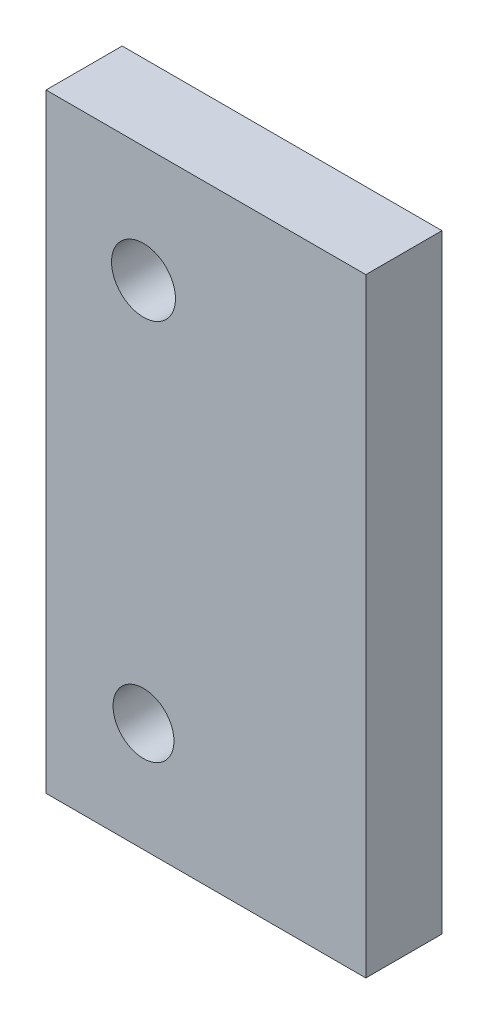
ISO-10303-21;
HEADER;
FILE_DESCRIPTION(('STEP AP214'),'2;1');
FILE_NAME('part.step','',(''),(''),'','','');
FILE_SCHEMA(('AUTOMOTIVE_DESIGN { 1 0 10303 214 1 1 1 1 }'));
ENDSEC;
DATA;
#1=APPLICATION_CONTEXT('core data for automotive mechanical design processes');
#2=APPLICATION_PROTOCOL_DEFINITION('international standard','automotive_design',2000,#1);
#3=PRODUCT_CONTEXT('',#1,'mechanical');
#4=PRODUCT('Part','Part','',(#3));
#5=PRODUCT_RELATED_PRODUCT_CATEGORY('part','',(#4));
#6=PRODUCT_DEFINITION_FORMATION('','',#4);
#7=PRODUCT_DEFINITION_CONTEXT('part definition',#1,'design');
#8=PRODUCT_DEFINITION('design','',#6,#7);
#9=PRODUCT_DEFINITION_SHAPE('','',#8);
#10=(LENGTH_UNIT() NAMED_UNIT(*) SI_UNIT(.MILLI.,.METRE.));
#11=(NAMED_UNIT(*) PLANE_ANGLE_UNIT() SI_UNIT($,.RADIAN.));
#12=(NAMED_UNIT(*) SI_UNIT($,.STERADIAN.) SOLID_ANGLE_UNIT());
#13=UNCERTAINTY_MEASURE_WITH_UNIT(LENGTH_MEASURE(1.E-05),#10,'distance_accuracy_value','');
#14=(GEOMETRIC_REPRESENTATION_CONTEXT(3) GLOBAL_UNCERTAINTY_ASSIGNED_CONTEXT((#13)) GLOBAL_UNIT_ASSIGNED_CONTEXT((#10,
#11,#12)) REPRESENTATION_CONTEXT('',''));
#15=CARTESIAN_POINT('',(0.,0.,0.));
#16=DIRECTION('',(0.,0.,1.));
#17=DIRECTION('',(1.,0.,0.));
#18=AXIS2_PLACEMENT_3D('',#15,#16,#17);
#19=CARTESIAN_POINT('',(10.5,0.,2.5));
#20=DIRECTION('',(0.,1.,0.));
#21=DIRECTION('',(-1.,0.,0.));
#22=AXIS2_PLACEMENT_3D('',#19,#20,#21);
#23=PLANE('',#22);
#24=DIRECTION('',(1.,0.,0.));
#25=VECTOR('',#24,1.);
#26=CARTESIAN_POINT('',(10.5,0.,0.));
#27=LINE('',#26,#25);
#28=CARTESIAN_POINT('',(0.,0.,0.));
#29=VERTEX_POINT('',#28);
#30=CARTESIAN_POINT('',(10.5,0.,0.));
#31=VERTEX_POINT('',#30);
#32=EDGE_CURVE('E98',#29,#31,#27,.T.);
#33=ORIENTED_EDGE('',*,*,#32,.T.);
#34=DIRECTION('',(0.,0.,-1.));
#35=VECTOR('',#34,1.);
#36=CARTESIAN_POINT('',(10.5,0.,2.5));
#37=LINE('',#36,#35);
#38=CARTESIAN_POINT('',(10.5,0.,2.5));
#39=VERTEX_POINT('',#38);
#40=EDGE_CURVE('E11',#39,#31,#37,.T.);
#41=ORIENTED_EDGE('',*,*,#40,.F.);
#42=DIRECTION('',(1.,0.,0.));
#43=VECTOR('',#42,1.);
#44=CARTESIAN_POINT('',(10.5,0.,2.5));
#45=LINE('',#44,#43);
#46=CARTESIAN_POINT('',(0.,0.,2.5));
#47=VERTEX_POINT('',#46);
#48=EDGE_CURVE('E86',#47,#39,#45,.T.);
#49=ORIENTED_EDGE('',*,*,#48,.F.);
#50=DIRECTION('',(0.,0.,-1.));
#51=VECTOR('',#50,1.);
#52=CARTESIAN_POINT('',(0.,0.,2.5));
#53=LINE('',#52,#51);
#54=EDGE_CURVE('E94',#47,#29,#53,.T.);
#55=ORIENTED_EDGE('',*,*,#54,.T.);
#56=EDGE_LOOP('',(#33,#41,#49,#55));
#57=FACE_BOUND('',#56,.T.);
#58=ADVANCED_FACE('F35',(#57),#23,.F.);
#59=CARTESIAN_POINT('',(10.5,20.,2.5));
#60=DIRECTION('',(-1.,0.,0.));
#61=DIRECTION('',(0.,-1.,0.));
#62=AXIS2_PLACEMENT_3D('',#59,#60,#61);
#63=PLANE('',#62);
#64=DIRECTION('',(0.,1.,0.));
#65=VECTOR('',#64,1.);
#66=CARTESIAN_POINT('',(10.5,20.,0.));
#67=LINE('',#66,#65);
#68=CARTESIAN_POINT('',(10.5,20.,0.));
#69=VERTEX_POINT('',#68);
#70=EDGE_CURVE('E90',#31,#69,#67,.T.);
#71=ORIENTED_EDGE('',*,*,#70,.T.);
#72=DIRECTION('',(0.,0.,-1.));
#73=VECTOR('',#72,1.);
#74=CARTESIAN_POINT('',(10.5,20.,2.5));
#75=LINE('',#74,#73);
#76=CARTESIAN_POINT('',(10.5,20.,2.5));
#77=VERTEX_POINT('',#76);
#78=EDGE_CURVE('E43',#77,#69,#75,.T.);
#79=ORIENTED_EDGE('',*,*,#78,.F.);
#80=DIRECTION('',(0.,1.,0.));
#81=VECTOR('',#80,1.);
#82=CARTESIAN_POINT('',(10.5,20.,2.5));
#83=LINE('',#82,#81);
#84=EDGE_CURVE('E81',#39,#77,#83,.T.);
#85=ORIENTED_EDGE('',*,*,#84,.F.);
#86=ORIENTED_EDGE('',*,*,#40,.T.);
#87=EDGE_LOOP('',(#71,#79,#85,#86));
#88=FACE_BOUND('',#87,.T.);
#89=ADVANCED_FACE('F89',(#88),#63,.F.);
#90=CARTESIAN_POINT('',(0.,20.,2.5));
#91=DIRECTION('',(0.,-1.,0.));
#92=DIRECTION('',(1.,0.,0.));
#93=AXIS2_PLACEMENT_3D('',#90,#91,#92);
#94=PLANE('',#93);
#95=DIRECTION('',(-1.,0.,0.));
#96=VECTOR('',#95,1.);
#97=CARTESIAN_POINT('',(0.,20.,0.));
#98=LINE('',#97,#96);
#99=CARTESIAN_POINT('',(0.,20.,0.));
#100=VERTEX_POINT('',#99);
#101=EDGE_CURVE('E68',#69,#100,#98,.T.);
#102=ORIENTED_EDGE('',*,*,#101,.T.);
#103=DIRECTION('',(0.,0.,-1.));
#104=VECTOR('',#103,1.);
#105=CARTESIAN_POINT('',(0.,20.,2.5));
#106=LINE('',#105,#104);
#107=CARTESIAN_POINT('',(0.,20.,2.5));
#108=VERTEX_POINT('',#107);
#109=EDGE_CURVE('E91',#108,#100,#106,.T.);
#110=ORIENTED_EDGE('',*,*,#109,.F.);
#111=DIRECTION('',(-1.,0.,0.));
#112=VECTOR('',#111,1.);
#113=CARTESIAN_POINT('',(0.,20.,2.5));
#114=LINE('',#113,#112);
#115=EDGE_CURVE('E84',#77,#108,#114,.T.);
#116=ORIENTED_EDGE('',*,*,#115,.F.);
#117=ORIENTED_EDGE('',*,*,#78,.T.);
#118=EDGE_LOOP('',(#102,#110,#116,#117));
#119=FACE_BOUND('',#118,.T.);
#120=ADVANCED_FACE('F92',(#119),#94,.F.);
#121=CARTESIAN_POINT('',(0.,0.,2.5));
#122=DIRECTION('',(1.,0.,0.));
#123=DIRECTION('',(0.,1.,0.));
#124=AXIS2_PLACEMENT_3D('',#121,#122,#123);
#125=PLANE('',#124);
#126=DIRECTION('',(0.,-1.,0.));
#127=VECTOR('',#126,1.);
#128=CARTESIAN_POINT('',(0.,0.,0.));
#129=LINE('',#128,#127);
#130=EDGE_CURVE('E74',#100,#29,#129,.T.);
#131=ORIENTED_EDGE('',*,*,#130,.T.);
#132=ORIENTED_EDGE('',*,*,#54,.F.);
#133=DIRECTION('',(0.,-1.,0.));
#134=VECTOR('',#133,1.);
#135=CARTESIAN_POINT('',(0.,0.,2.5));
#136=LINE('',#135,#134);
#137=EDGE_CURVE('E51',#108,#47,#136,.T.);
#138=ORIENTED_EDGE('',*,*,#137,.F.);
#139=ORIENTED_EDGE('',*,*,#109,.T.);
#140=EDGE_LOOP('',(#131,#132,#138,#139));
#141=FACE_BOUND('',#140,.T.);
#142=ADVANCED_FACE('F106',(#141),#125,.F.);
#143=CARTESIAN_POINT('',(0.,0.,2.5));
#144=DIRECTION('',(0.,0.,-1.));
#145=DIRECTION('',(-1.,0.,0.));
#146=AXIS2_PLACEMENT_3D('',#143,#144,#145);
#147=PLANE('',#146);
#148=CARTESIAN_POINT('',(3.19999999999999,16.1882803570095,2.5));
#149=DIRECTION('',(0.,0.,1.));
#150=DIRECTION('',(1.,0.,0.));
#151=AXIS2_PLACEMENT_3D('',#148,#149,#150);
#152=CIRCLE('',#151,1.05);
#153=CARTESIAN_POINT('',(4.24999999999999,16.1882803570095,2.5));
#154=VERTEX_POINT('',#153);
#155=EDGE_CURVE('E118',#154,#154,#152,.T.);
#156=ORIENTED_EDGE('',*,*,#155,.F.);
#157=EDGE_LOOP('',(#156));
#158=FACE_BOUND('',#157,.T.);
#159=CARTESIAN_POINT('',(3.19999999999999,3.58828035700945,2.5));
#160=DIRECTION('',(0.,0.,1.));
#161=DIRECTION('',(1.,0.,0.));
#162=AXIS2_PLACEMENT_3D('',#159,#160,#161);
#163=CIRCLE('',#162,0.999999999999999);
#164=CARTESIAN_POINT('',(4.19999999999999,3.58828035700945,2.5));
#165=VERTEX_POINT('',#164);
#166=EDGE_CURVE('E112',#165,#165,#163,.T.);
#167=ORIENTED_EDGE('',*,*,#166,.F.);
#168=EDGE_LOOP('',(#167));
#169=FACE_BOUND('',#168,.T.);
#170=ORIENTED_EDGE('',*,*,#48,.T.);
#171=ORIENTED_EDGE('',*,*,#84,.T.);
#172=ORIENTED_EDGE('',*,*,#115,.T.);
#173=ORIENTED_EDGE('',*,*,#137,.T.);
#174=EDGE_LOOP('',(#170,#171,#172,#173));
#175=FACE_BOUND('',#174,.T.);
#176=ADVANCED_FACE('F82',(#158,#169,#175),#147,.F.);
#177=CARTESIAN_POINT('',(0.,0.,0.));
#178=DIRECTION('',(0.,0.,-1.));
#179=DIRECTION('',(-1.,0.,0.));
#180=AXIS2_PLACEMENT_3D('',#177,#178,#179);
#181=PLANE('',#180);
#182=CARTESIAN_POINT('',(3.19999999999999,16.1882803570095,0.));
#183=DIRECTION('',(0.,0.,1.));
#184=DIRECTION('',(1.,0.,0.));
#185=AXIS2_PLACEMENT_3D('',#182,#183,#184);
#186=CIRCLE('',#185,1.05);
#187=CARTESIAN_POINT('',(4.24999999999999,16.1882803570095,0.));
#188=VERTEX_POINT('',#187);
#189=EDGE_CURVE('E101',#188,#188,#186,.T.);
#190=ORIENTED_EDGE('',*,*,#189,.T.);
#191=EDGE_LOOP('',(#190));
#192=FACE_BOUND('',#191,.T.);
#193=CARTESIAN_POINT('',(3.19999999999999,3.58828035700945,0.));
#194=DIRECTION('',(0.,0.,1.));
#195=DIRECTION('',(1.,0.,0.));
#196=AXIS2_PLACEMENT_3D('',#193,#194,#195);
#197=CIRCLE('',#196,0.999999999999999);
#198=CARTESIAN_POINT('',(4.19999999999999,3.58828035700945,0.));
#199=VERTEX_POINT('',#198);
#200=EDGE_CURVE('E115',#199,#199,#197,.T.);
#201=ORIENTED_EDGE('',*,*,#200,.T.);
#202=EDGE_LOOP('',(#201));
#203=FACE_BOUND('',#202,.T.);
#204=ORIENTED_EDGE('',*,*,#32,.F.);
#205=ORIENTED_EDGE('',*,*,#130,.F.);
#206=ORIENTED_EDGE('',*,*,#101,.F.);
#207=ORIENTED_EDGE('',*,*,#70,.F.);
#208=EDGE_LOOP('',(#204,#205,#206,#207));
#209=FACE_BOUND('',#208,.T.);
#210=ADVANCED_FACE('F109',(#192,#203,#209),#181,.T.);
#211=CARTESIAN_POINT('',(3.19999999999999,3.58828035700945,0.));
#212=DIRECTION('',(0.,0.,1.));
#213=DIRECTION('',(1.,0.,0.));
#214=AXIS2_PLACEMENT_3D('',#211,#212,#213);
#215=CYLINDRICAL_SURFACE('',#214,0.999999999999999);
#216=ORIENTED_EDGE('',*,*,#200,.F.);
#217=EDGE_LOOP('',(#216));
#218=FACE_BOUND('',#217,.T.);
#219=ORIENTED_EDGE('',*,*,#166,.T.);
#220=EDGE_LOOP('',(#219));
#221=FACE_BOUND('',#220,.T.);
#222=ADVANCED_FACE('F129',(#218,#221),#215,.F.);
#223=CARTESIAN_POINT('',(3.19999999999999,16.1882803570095,0.));
#224=DIRECTION('',(0.,0.,1.));
#225=DIRECTION('',(1.,0.,0.));
#226=AXIS2_PLACEMENT_3D('',#223,#224,#225);
#227=CYLINDRICAL_SURFACE('',#226,1.05);
#228=ORIENTED_EDGE('',*,*,#189,.F.);
#229=EDGE_LOOP('',(#228));
#230=FACE_BOUND('',#229,.T.);
#231=ORIENTED_EDGE('',*,*,#155,.T.);
#232=EDGE_LOOP('',(#231));
#233=FACE_BOUND('',#232,.T.);
#234=ADVANCED_FACE('F126',(#230,#233),#227,.F.);
#235=CLOSED_SHELL('',(#58,#89,#120,#142,#176,#210,#222,#234));
#236=MANIFOLD_SOLID_BREP('B2',#235);
#237=ADVANCED_BREP_SHAPE_REPRESENTATION('',(#18,#236),#14);
#238=SHAPE_DEFINITION_REPRESENTATION(#9,#237);
ENDSEC;
END-ISO-10303-21;
